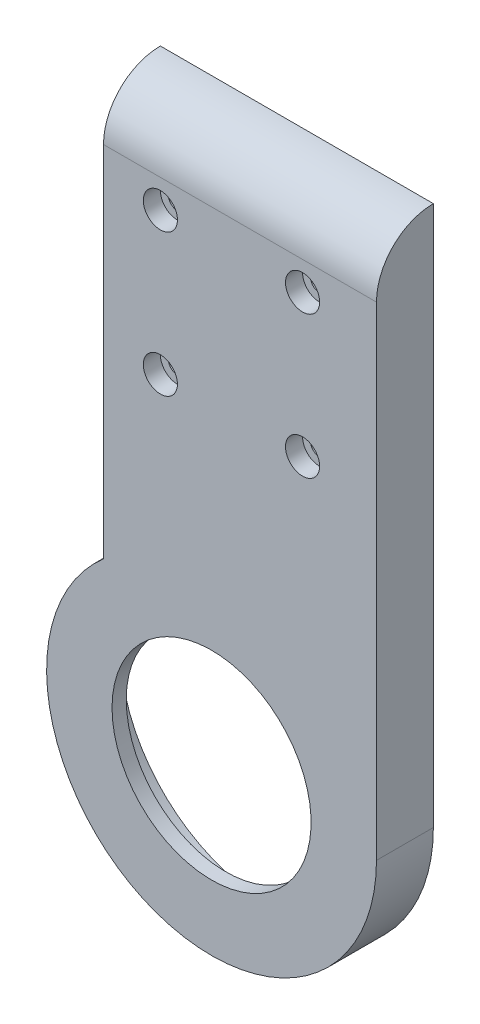
ISO-10303-21;
HEADER;
FILE_DESCRIPTION(('STEP AP214'),'2;1');
FILE_NAME('part.step','',(''),(''),'','','');
FILE_SCHEMA(('AUTOMOTIVE_DESIGN { 1 0 10303 214 1 1 1 1 }'));
ENDSEC;
DATA;
#1=APPLICATION_CONTEXT('core data for automotive mechanical design processes');
#2=APPLICATION_PROTOCOL_DEFINITION('international standard','automotive_design',2000,#1);
#3=PRODUCT_CONTEXT('',#1,'mechanical');
#4=PRODUCT('Part','Part','',(#3));
#5=PRODUCT_RELATED_PRODUCT_CATEGORY('part','',(#4));
#6=PRODUCT_DEFINITION_FORMATION('','',#4);
#7=PRODUCT_DEFINITION_CONTEXT('part definition',#1,'design');
#8=PRODUCT_DEFINITION('design','',#6,#7);
#9=PRODUCT_DEFINITION_SHAPE('','',#8);
#10=(LENGTH_UNIT() NAMED_UNIT(*) SI_UNIT(.MILLI.,.METRE.));
#11=(NAMED_UNIT(*) PLANE_ANGLE_UNIT() SI_UNIT($,.RADIAN.));
#12=(NAMED_UNIT(*) SI_UNIT($,.STERADIAN.) SOLID_ANGLE_UNIT());
#13=UNCERTAINTY_MEASURE_WITH_UNIT(LENGTH_MEASURE(1.E-05),#10,'distance_accuracy_value','');
#14=(GEOMETRIC_REPRESENTATION_CONTEXT(3) GLOBAL_UNCERTAINTY_ASSIGNED_CONTEXT((#13)) GLOBAL_UNIT_ASSIGNED_CONTEXT((#10,
#11,#12)) REPRESENTATION_CONTEXT('',''));
#15=CARTESIAN_POINT('',(0.,0.,0.));
#16=DIRECTION('',(0.,0.,1.));
#17=DIRECTION('',(1.,0.,0.));
#18=AXIS2_PLACEMENT_3D('',#15,#16,#17);
#19=CARTESIAN_POINT('',(-9.,80.,0.));
#20=DIRECTION('',(0.,0.,1.));
#21=DIRECTION('',(1.,0.,0.));
#22=AXIS2_PLACEMENT_3D('',#19,#20,#21);
#23=CYLINDRICAL_SURFACE('',#22,1.60000000000001);
#24=CARTESIAN_POINT('',(-9.,80.,0.));
#25=DIRECTION('',(0.,0.,1.));
#26=DIRECTION('',(1.,0.,0.));
#27=AXIS2_PLACEMENT_3D('',#24,#25,#26);
#28=CIRCLE('',#27,1.60000000000001);
#29=CARTESIAN_POINT('',(-7.39999999999999,80.,0.));
#30=VERTEX_POINT('',#29);
#31=EDGE_CURVE('E141',#30,#30,#28,.T.);
#32=ORIENTED_EDGE('',*,*,#31,.F.);
#33=EDGE_LOOP('',(#32));
#34=FACE_BOUND('',#33,.T.);
#35=CARTESIAN_POINT('',(-9.,80.,7.));
#36=DIRECTION('',(0.,0.,1.));
#37=DIRECTION('',(1.,0.,0.));
#38=AXIS2_PLACEMENT_3D('',#35,#36,#37);
#39=CIRCLE('',#38,1.60000000000001);
#40=CARTESIAN_POINT('',(-7.39999999999999,80.,7.));
#41=VERTEX_POINT('',#40);
#42=EDGE_CURVE('E44',#41,#41,#39,.F.);
#43=ORIENTED_EDGE('',*,*,#42,.F.);
#44=EDGE_LOOP('',(#43));
#45=FACE_BOUND('',#44,.T.);
#46=ADVANCED_FACE('F40',(#34,#45),#23,.F.);
#47=CARTESIAN_POINT('',(16.,80.,0.));
#48=DIRECTION('',(0.,0.,1.));
#49=DIRECTION('',(1.,0.,0.));
#50=AXIS2_PLACEMENT_3D('',#47,#48,#49);
#51=CYLINDRICAL_SURFACE('',#50,1.60000000000001);
#52=CARTESIAN_POINT('',(16.,80.,0.));
#53=DIRECTION('',(0.,0.,1.));
#54=DIRECTION('',(1.,0.,0.));
#55=AXIS2_PLACEMENT_3D('',#52,#53,#54);
#56=CIRCLE('',#55,1.60000000000001);
#57=CARTESIAN_POINT('',(17.6,80.,0.));
#58=VERTEX_POINT('',#57);
#59=EDGE_CURVE('E137',#58,#58,#56,.T.);
#60=ORIENTED_EDGE('',*,*,#59,.F.);
#61=EDGE_LOOP('',(#60));
#62=FACE_BOUND('',#61,.T.);
#63=CARTESIAN_POINT('',(16.,80.,7.));
#64=DIRECTION('',(0.,0.,1.));
#65=DIRECTION('',(1.,0.,0.));
#66=AXIS2_PLACEMENT_3D('',#63,#64,#65);
#67=CIRCLE('',#66,1.60000000000001);
#68=CARTESIAN_POINT('',(17.6,80.,7.));
#69=VERTEX_POINT('',#68);
#70=EDGE_CURVE('E123',#69,#69,#67,.F.);
#71=ORIENTED_EDGE('',*,*,#70,.F.);
#72=EDGE_LOOP('',(#71));
#73=FACE_BOUND('',#72,.T.);
#74=ADVANCED_FACE('F183',(#62,#73),#51,.F.);
#75=CARTESIAN_POINT('',(16.0000000000013,55.,0.));
#76=DIRECTION('',(0.,0.,1.));
#77=DIRECTION('',(1.,0.,0.));
#78=AXIS2_PLACEMENT_3D('',#75,#76,#77);
#79=CYLINDRICAL_SURFACE('',#78,1.6);
#80=CARTESIAN_POINT('',(16.0000000000013,55.,0.));
#81=DIRECTION('',(0.,0.,1.));
#82=DIRECTION('',(1.,0.,0.));
#83=AXIS2_PLACEMENT_3D('',#80,#81,#82);
#84=CIRCLE('',#83,1.6);
#85=CARTESIAN_POINT('',(17.6000000000013,55.,0.));
#86=VERTEX_POINT('',#85);
#87=EDGE_CURVE('E132',#86,#86,#84,.T.);
#88=ORIENTED_EDGE('',*,*,#87,.F.);
#89=EDGE_LOOP('',(#88));
#90=FACE_BOUND('',#89,.T.);
#91=CARTESIAN_POINT('',(16.0000000000013,55.,7.));
#92=DIRECTION('',(0.,0.,1.));
#93=DIRECTION('',(1.,0.,0.));
#94=AXIS2_PLACEMENT_3D('',#91,#92,#93);
#95=CIRCLE('',#94,1.6);
#96=CARTESIAN_POINT('',(17.6000000000013,55.,7.));
#97=VERTEX_POINT('',#96);
#98=EDGE_CURVE('E120',#97,#97,#95,.F.);
#99=ORIENTED_EDGE('',*,*,#98,.F.);
#100=EDGE_LOOP('',(#99));
#101=FACE_BOUND('',#100,.T.);
#102=ADVANCED_FACE('F189',(#90,#101),#79,.F.);
#103=CARTESIAN_POINT('',(-8.99999999999867,55.,0.));
#104=DIRECTION('',(0.,0.,1.));
#105=DIRECTION('',(1.,0.,0.));
#106=AXIS2_PLACEMENT_3D('',#103,#104,#105);
#107=CYLINDRICAL_SURFACE('',#106,1.59999999999999);
#108=CARTESIAN_POINT('',(-8.99999999999867,55.,0.));
#109=DIRECTION('',(0.,0.,1.));
#110=DIRECTION('',(1.,0.,0.));
#111=AXIS2_PLACEMENT_3D('',#108,#109,#110);
#112=CIRCLE('',#111,1.59999999999999);
#113=CARTESIAN_POINT('',(-7.39999999999868,55.,0.));
#114=VERTEX_POINT('',#113);
#115=EDGE_CURVE('E128',#114,#114,#112,.T.);
#116=ORIENTED_EDGE('',*,*,#115,.F.);
#117=EDGE_LOOP('',(#116));
#118=FACE_BOUND('',#117,.T.);
#119=CARTESIAN_POINT('',(-8.99999999999867,55.,7.));
#120=DIRECTION('',(0.,0.,1.));
#121=DIRECTION('',(1.,0.,0.));
#122=AXIS2_PLACEMENT_3D('',#119,#120,#121);
#123=CIRCLE('',#122,1.59999999999999);
#124=CARTESIAN_POINT('',(-7.39999999999868,55.,7.));
#125=VERTEX_POINT('',#124);
#126=EDGE_CURVE('E117',#125,#125,#123,.F.);
#127=ORIENTED_EDGE('',*,*,#126,.F.);
#128=EDGE_LOOP('',(#127));
#129=FACE_BOUND('',#128,.T.);
#130=ADVANCED_FACE('F195',(#118,#129),#107,.F.);
#131=CARTESIAN_POINT('',(0.,0.,7.5));
#132=DIRECTION('',(0.,0.,-1.));
#133=DIRECTION('',(-1.,0.,0.));
#134=AXIS2_PLACEMENT_3D('',#131,#132,#133);
#135=PLANE('',#134);
#136=CARTESIAN_POINT('',(0.,0.,7.5));
#137=DIRECTION('',(0.,0.,-1.));
#138=DIRECTION('',(-1.,0.,0.));
#139=AXIS2_PLACEMENT_3D('',#136,#137,#138);
#140=CIRCLE('',#139,17.5);
#141=CARTESIAN_POINT('',(-17.5,0.,7.5));
#142=VERTEX_POINT('',#141);
#143=EDGE_CURVE('E151',#142,#142,#140,.T.);
#144=ORIENTED_EDGE('',*,*,#143,.F.);
#145=EDGE_LOOP('',(#144));
#146=FACE_BOUND('',#145,.T.);
#147=CARTESIAN_POINT('',(0.,0.,7.5));
#148=DIRECTION('',(0.,0.,-1.));
#149=DIRECTION('',(-1.,0.,0.));
#150=AXIS2_PLACEMENT_3D('',#147,#148,#149);
#151=CIRCLE('',#150,24.);
#152=CARTESIAN_POINT('',(-24.,0.,7.5));
#153=VERTEX_POINT('',#152);
#154=EDGE_CURVE('E107',#153,#153,#151,.F.);
#155=ORIENTED_EDGE('',*,*,#154,.F.);
#156=EDGE_LOOP('',(#155));
#157=FACE_BOUND('',#156,.T.);
#158=ADVANCED_FACE('F214',(#146,#157),#135,.T.);
#159=CARTESIAN_POINT('',(0.,0.,10.));
#160=DIRECTION('',(0.,0.,1.));
#161=DIRECTION('',(1.,0.,0.));
#162=AXIS2_PLACEMENT_3D('',#159,#160,#161);
#163=PLANE('',#162);
#164=CARTESIAN_POINT('',(-8.99999999999867,55.,10.));
#165=DIRECTION('',(0.,0.,1.));
#166=DIRECTION('',(1.,0.,0.));
#167=AXIS2_PLACEMENT_3D('',#164,#165,#166);
#168=CIRCLE('',#167,3.);
#169=CARTESIAN_POINT('',(-5.99999999999867,55.,10.));
#170=VERTEX_POINT('',#169);
#171=EDGE_CURVE('E249',#170,#170,#168,.T.);
#172=ORIENTED_EDGE('',*,*,#171,.F.);
#173=EDGE_LOOP('',(#172));
#174=FACE_BOUND('',#173,.T.);
#175=CARTESIAN_POINT('',(16.0000000000013,55.,10.));
#176=DIRECTION('',(0.,0.,1.));
#177=DIRECTION('',(1.,0.,0.));
#178=AXIS2_PLACEMENT_3D('',#175,#176,#177);
#179=CIRCLE('',#178,3.);
#180=CARTESIAN_POINT('',(19.0000000000013,55.,10.));
#181=VERTEX_POINT('',#180);
#182=EDGE_CURVE('E255',#181,#181,#179,.T.);
#183=ORIENTED_EDGE('',*,*,#182,.F.);
#184=EDGE_LOOP('',(#183));
#185=FACE_BOUND('',#184,.T.);
#186=CARTESIAN_POINT('',(16.,80.,10.));
#187=DIRECTION('',(0.,0.,1.));
#188=DIRECTION('',(1.,0.,0.));
#189=AXIS2_PLACEMENT_3D('',#186,#187,#188);
#190=CIRCLE('',#189,3.);
#191=CARTESIAN_POINT('',(19.,80.,10.));
#192=VERTEX_POINT('',#191);
#193=EDGE_CURVE('E243',#192,#192,#190,.T.);
#194=ORIENTED_EDGE('',*,*,#193,.F.);
#195=EDGE_LOOP('',(#194));
#196=FACE_BOUND('',#195,.T.);
#197=CARTESIAN_POINT('',(-9.,80.,10.));
#198=DIRECTION('',(0.,0.,1.));
#199=DIRECTION('',(1.,0.,0.));
#200=AXIS2_PLACEMENT_3D('',#197,#198,#199);
#201=CIRCLE('',#200,3.);
#202=CARTESIAN_POINT('',(-6.,80.,10.));
#203=VERTEX_POINT('',#202);
#204=EDGE_CURVE('E240',#203,#203,#201,.T.);
#205=ORIENTED_EDGE('',*,*,#204,.F.);
#206=EDGE_LOOP('',(#205));
#207=FACE_BOUND('',#206,.T.);
#208=CARTESIAN_POINT('',(0.,0.,10.));
#209=DIRECTION('',(0.,0.,-1.));
#210=DIRECTION('',(-1.,0.,0.));
#211=AXIS2_PLACEMENT_3D('',#208,#209,#210);
#212=CIRCLE('',#211,17.5);
#213=CARTESIAN_POINT('',(-17.5,0.,10.));
#214=VERTEX_POINT('',#213);
#215=EDGE_CURVE('E154',#214,#214,#212,.T.);
#216=ORIENTED_EDGE('',*,*,#215,.T.);
#217=EDGE_LOOP('',(#216));
#218=FACE_BOUND('',#217,.T.);
#219=DIRECTION('',(0.,-1.,0.));
#220=VECTOR('',#219,1.);
#221=CARTESIAN_POINT('',(29.,0.,10.));
#222=LINE('',#221,#220);
#223=CARTESIAN_POINT('',(29.,85.,10.));
#224=VERTEX_POINT('',#223);
#225=CARTESIAN_POINT('',(29.,0.,10.));
#226=VERTEX_POINT('',#225);
#227=EDGE_CURVE('E104',#224,#226,#222,.T.);
#228=ORIENTED_EDGE('',*,*,#227,.F.);
#229=DIRECTION('',(1.,0.,0.));
#230=VECTOR('',#229,1.);
#231=CARTESIAN_POINT('',(-19.,85.,10.));
#232=LINE('',#231,#230);
#233=CARTESIAN_POINT('',(-19.,85.,10.));
#234=VERTEX_POINT('',#233);
#235=EDGE_CURVE('E49',#224,#234,#232,.F.);
#236=ORIENTED_EDGE('',*,*,#235,.T.);
#237=DIRECTION('',(0.,1.,0.));
#238=VECTOR('',#237,1.);
#239=CARTESIAN_POINT('',(-19.,0.,10.));
#240=LINE('',#239,#238);
#241=CARTESIAN_POINT('',(-19.,21.9089023002066,10.));
#242=VERTEX_POINT('',#241);
#243=EDGE_CURVE('E101',#242,#234,#240,.T.);
#244=ORIENTED_EDGE('',*,*,#243,.F.);
#245=CARTESIAN_POINT('',(0.,0.,10.));
#246=DIRECTION('',(0.,0.,-1.));
#247=DIRECTION('',(-1.,0.,0.));
#248=AXIS2_PLACEMENT_3D('',#245,#246,#247);
#249=CIRCLE('',#248,29.);
#250=EDGE_CURVE('E93',#226,#242,#249,.T.);
#251=ORIENTED_EDGE('',*,*,#250,.F.);
#252=EDGE_LOOP('',(#228,#236,#244,#251));
#253=FACE_BOUND('',#252,.T.);
#254=ADVANCED_FACE('F224',(#174,#185,#196,#207,#218,#253),#163,.T.);
#255=CARTESIAN_POINT('',(0.,0.,0.));
#256=DIRECTION('',(0.,0.,1.));
#257=DIRECTION('',(1.,0.,0.));
#258=AXIS2_PLACEMENT_3D('',#255,#256,#257);
#259=PLANE('',#258);
#260=ORIENTED_EDGE('',*,*,#115,.T.);
#261=EDGE_LOOP('',(#260));
#262=FACE_BOUND('',#261,.T.);
#263=ORIENTED_EDGE('',*,*,#87,.T.);
#264=EDGE_LOOP('',(#263));
#265=FACE_BOUND('',#264,.T.);
#266=ORIENTED_EDGE('',*,*,#59,.T.);
#267=EDGE_LOOP('',(#266));
#268=FACE_BOUND('',#267,.T.);
#269=ORIENTED_EDGE('',*,*,#31,.T.);
#270=EDGE_LOOP('',(#269));
#271=FACE_BOUND('',#270,.T.);
#272=CARTESIAN_POINT('',(0.,0.,0.));
#273=DIRECTION('',(0.,0.,-1.));
#274=DIRECTION('',(-1.,0.,0.));
#275=AXIS2_PLACEMENT_3D('',#272,#273,#274);
#276=CIRCLE('',#275,26.1);
#277=CARTESIAN_POINT('',(-26.1,0.,0.));
#278=VERTEX_POINT('',#277);
#279=EDGE_CURVE('E157',#278,#278,#276,.T.);
#280=ORIENTED_EDGE('',*,*,#279,.F.);
#281=EDGE_LOOP('',(#280));
#282=FACE_BOUND('',#281,.T.);
#283=DIRECTION('',(0.,-1.,0.));
#284=VECTOR('',#283,1.);
#285=CARTESIAN_POINT('',(29.,0.,0.));
#286=LINE('',#285,#284);
#287=CARTESIAN_POINT('',(29.,95.,0.));
#288=VERTEX_POINT('',#287);
#289=CARTESIAN_POINT('',(29.,0.,0.));
#290=VERTEX_POINT('',#289);
#291=EDGE_CURVE('E97',#288,#290,#286,.T.);
#292=ORIENTED_EDGE('',*,*,#291,.T.);
#293=CARTESIAN_POINT('',(0.,0.,0.));
#294=DIRECTION('',(0.,0.,-1.));
#295=DIRECTION('',(-1.,0.,0.));
#296=AXIS2_PLACEMENT_3D('',#293,#294,#295);
#297=CIRCLE('',#296,29.);
#298=CARTESIAN_POINT('',(-19.,21.9089023002066,0.));
#299=VERTEX_POINT('',#298);
#300=EDGE_CURVE('E82',#290,#299,#297,.T.);
#301=ORIENTED_EDGE('',*,*,#300,.T.);
#302=DIRECTION('',(0.,1.,0.));
#303=VECTOR('',#302,1.);
#304=CARTESIAN_POINT('',(-19.,0.,0.));
#305=LINE('',#304,#303);
#306=CARTESIAN_POINT('',(-19.,95.,0.));
#307=VERTEX_POINT('',#306);
#308=EDGE_CURVE('E105',#299,#307,#305,.T.);
#309=ORIENTED_EDGE('',*,*,#308,.T.);
#310=DIRECTION('',(1.,0.,0.));
#311=VECTOR('',#310,1.);
#312=CARTESIAN_POINT('',(0.,95.,0.));
#313=LINE('',#312,#311);
#314=EDGE_CURVE('E100',#307,#288,#313,.T.);
#315=ORIENTED_EDGE('',*,*,#314,.T.);
#316=EDGE_LOOP('',(#292,#301,#309,#315));
#317=FACE_BOUND('',#316,.T.);
#318=ADVANCED_FACE('F98',(#262,#265,#268,#271,#282,#317),#259,.F.);
#319=CARTESIAN_POINT('',(29.,0.,0.));
#320=DIRECTION('',(-1.,0.,0.));
#321=DIRECTION('',(0.,-1.,0.));
#322=AXIS2_PLACEMENT_3D('',#319,#320,#321);
#323=PLANE('',#322);
#324=ORIENTED_EDGE('',*,*,#291,.F.);
#325=CARTESIAN_POINT('',(29.,85.,0.));
#326=DIRECTION('',(-1.,0.,0.));
#327=DIRECTION('',(0.,-1.,0.));
#328=AXIS2_PLACEMENT_3D('',#325,#326,#327);
#329=CIRCLE('',#328,10.);
#330=EDGE_CURVE('E64',#288,#224,#329,.F.);
#331=ORIENTED_EDGE('',*,*,#330,.T.);
#332=ORIENTED_EDGE('',*,*,#227,.T.);
#333=DIRECTION('',(0.,0.,1.));
#334=VECTOR('',#333,1.);
#335=CARTESIAN_POINT('',(29.,0.,0.));
#336=LINE('',#335,#334);
#337=EDGE_CURVE('E86',#290,#226,#336,.T.);
#338=ORIENTED_EDGE('',*,*,#337,.F.);
#339=EDGE_LOOP('',(#324,#331,#332,#338));
#340=FACE_BOUND('',#339,.T.);
#341=ADVANCED_FACE('F103',(#340),#323,.F.);
#342=CARTESIAN_POINT('',(-19.,0.,0.));
#343=DIRECTION('',(1.,0.,0.));
#344=DIRECTION('',(0.,0.,-1.));
#345=AXIS2_PLACEMENT_3D('',#342,#343,#344);
#346=PLANE('',#345);
#347=ORIENTED_EDGE('',*,*,#243,.T.);
#348=CARTESIAN_POINT('',(-19.,85.,0.));
#349=DIRECTION('',(1.,0.,0.));
#350=DIRECTION('',(0.,0.,-1.));
#351=AXIS2_PLACEMENT_3D('',#348,#349,#350);
#352=CIRCLE('',#351,10.);
#353=EDGE_CURVE('E11',#234,#307,#352,.F.);
#354=ORIENTED_EDGE('',*,*,#353,.T.);
#355=ORIENTED_EDGE('',*,*,#308,.F.);
#356=DIRECTION('',(0.,0.,-1.));
#357=VECTOR('',#356,1.);
#358=CARTESIAN_POINT('',(-19.,21.9089023002066,10.));
#359=LINE('',#358,#357);
#360=EDGE_CURVE('E89',#299,#242,#359,.F.);
#361=ORIENTED_EDGE('',*,*,#360,.T.);
#362=EDGE_LOOP('',(#347,#354,#355,#361));
#363=FACE_BOUND('',#362,.T.);
#364=ADVANCED_FACE('F167',(#363),#346,.F.);
#365=CARTESIAN_POINT('',(0.,0.,10.));
#366=DIRECTION('',(0.,0.,-1.));
#367=DIRECTION('',(-1.,0.,0.));
#368=AXIS2_PLACEMENT_3D('',#365,#366,#367);
#369=CYLINDRICAL_SURFACE('',#368,29.);
#370=ORIENTED_EDGE('',*,*,#337,.T.);
#371=ORIENTED_EDGE('',*,*,#250,.T.);
#372=ORIENTED_EDGE('',*,*,#360,.F.);
#373=ORIENTED_EDGE('',*,*,#300,.F.);
#374=EDGE_LOOP('',(#370,#371,#372,#373));
#375=FACE_BOUND('',#374,.T.);
#376=ADVANCED_FACE('F84',(#375),#369,.T.);
#377=CARTESIAN_POINT('',(0.,0.,7.5));
#378=DIRECTION('',(0.,0.,-1.));
#379=DIRECTION('',(-1.,0.,0.));
#380=AXIS2_PLACEMENT_3D('',#377,#378,#379);
#381=CYLINDRICAL_SURFACE('',#380,26.1);
#382=CARTESIAN_POINT('',(0.,0.,7.5));
#383=DIRECTION('',(0.,0.,-1.));
#384=DIRECTION('',(-1.,0.,0.));
#385=AXIS2_PLACEMENT_3D('',#382,#383,#384);
#386=CIRCLE('',#385,26.1);
#387=CARTESIAN_POINT('',(-26.1,0.,7.5));
#388=VERTEX_POINT('',#387);
#389=EDGE_CURVE('E94',#388,#388,#386,.T.);
#390=ORIENTED_EDGE('',*,*,#389,.F.);
#391=EDGE_LOOP('',(#390));
#392=FACE_BOUND('',#391,.T.);
#393=ORIENTED_EDGE('',*,*,#279,.T.);
#394=EDGE_LOOP('',(#393));
#395=FACE_BOUND('',#394,.T.);
#396=ADVANCED_FACE('F212',(#392,#395),#381,.F.);
#397=CARTESIAN_POINT('',(0.,0.,7.5));
#398=DIRECTION('',(0.,0.,-1.));
#399=DIRECTION('',(-1.,0.,0.));
#400=AXIS2_PLACEMENT_3D('',#397,#398,#399);
#401=CIRCLE('',#400,26.05);
#402=CARTESIAN_POINT('',(-26.05,0.,7.5));
#403=VERTEX_POINT('',#402);
#404=EDGE_CURVE('E147',#403,#403,#401,.T.);
#405=ORIENTED_EDGE('',*,*,#404,.F.);
#406=EDGE_LOOP('',(#405));
#407=FACE_BOUND('',#406,.T.);
#408=ORIENTED_EDGE('',*,*,#389,.T.);
#409=EDGE_LOOP('',(#408));
#410=FACE_BOUND('',#409,.T.);
#411=ADVANCED_FACE('F208',(#407,#410),#135,.T.);
#412=CARTESIAN_POINT('',(0.,0.,10.));
#413=DIRECTION('',(0.,0.,-1.));
#414=DIRECTION('',(-1.,0.,0.));
#415=AXIS2_PLACEMENT_3D('',#412,#413,#414);
#416=CYLINDRICAL_SURFACE('',#415,17.5);
#417=ORIENTED_EDGE('',*,*,#215,.F.);
#418=EDGE_LOOP('',(#417));
#419=FACE_BOUND('',#418,.T.);
#420=ORIENTED_EDGE('',*,*,#143,.T.);
#421=EDGE_LOOP('',(#420));
#422=FACE_BOUND('',#421,.T.);
#423=ADVANCED_FACE('F201',(#419,#422),#416,.F.);
#424=CARTESIAN_POINT('',(0.,0.,6.));
#425=DIRECTION('',(0.,0.,-1.));
#426=DIRECTION('',(-1.,0.,0.));
#427=AXIS2_PLACEMENT_3D('',#424,#425,#426);
#428=PLANE('',#427);
#429=CARTESIAN_POINT('',(0.,0.,6.));
#430=DIRECTION('',(0.,0.,-1.));
#431=DIRECTION('',(-1.,0.,0.));
#432=AXIS2_PLACEMENT_3D('',#429,#430,#431);
#433=CIRCLE('',#432,26.05);
#434=CARTESIAN_POINT('',(-26.05,0.,6.));
#435=VERTEX_POINT('',#434);
#436=EDGE_CURVE('E148',#435,#435,#433,.T.);
#437=ORIENTED_EDGE('',*,*,#436,.T.);
#438=EDGE_LOOP('',(#437));
#439=FACE_BOUND('',#438,.T.);
#440=CARTESIAN_POINT('',(0.,0.,6.));
#441=DIRECTION('',(0.,0.,-1.));
#442=DIRECTION('',(-1.,0.,0.));
#443=AXIS2_PLACEMENT_3D('',#440,#441,#442);
#444=CIRCLE('',#443,24.);
#445=CARTESIAN_POINT('',(-24.,0.,6.));
#446=VERTEX_POINT('',#445);
#447=EDGE_CURVE('E144',#446,#446,#444,.T.);
#448=ORIENTED_EDGE('',*,*,#447,.F.);
#449=EDGE_LOOP('',(#448));
#450=FACE_BOUND('',#449,.T.);
#451=ADVANCED_FACE('F198',(#439,#450),#428,.T.);
#452=CARTESIAN_POINT('',(0.,0.,6.));
#453=DIRECTION('',(0.,0.,1.));
#454=DIRECTION('',(1.,0.,0.));
#455=AXIS2_PLACEMENT_3D('',#452,#453,#454);
#456=CYLINDRICAL_SURFACE('',#455,26.05);
#457=ORIENTED_EDGE('',*,*,#436,.F.);
#458=EDGE_LOOP('',(#457));
#459=FACE_BOUND('',#458,.T.);
#460=ORIENTED_EDGE('',*,*,#404,.T.);
#461=EDGE_LOOP('',(#460));
#462=FACE_BOUND('',#461,.T.);
#463=ADVANCED_FACE('F179',(#459,#462),#456,.T.);
#464=CARTESIAN_POINT('',(0.,0.,6.));
#465=DIRECTION('',(0.,0.,1.));
#466=DIRECTION('',(1.,0.,0.));
#467=AXIS2_PLACEMENT_3D('',#464,#465,#466);
#468=CYLINDRICAL_SURFACE('',#467,24.);
#469=ORIENTED_EDGE('',*,*,#447,.T.);
#470=EDGE_LOOP('',(#469));
#471=FACE_BOUND('',#470,.T.);
#472=ORIENTED_EDGE('',*,*,#154,.T.);
#473=EDGE_LOOP('',(#472));
#474=FACE_BOUND('',#473,.T.);
#475=ADVANCED_FACE('F171',(#471,#474),#468,.F.);
#476=CARTESIAN_POINT('',(0.,85.,0.));
#477=DIRECTION('',(-1.,0.,0.));
#478=DIRECTION('',(0.,0.,1.));
#479=AXIS2_PLACEMENT_3D('',#476,#477,#478);
#480=CYLINDRICAL_SURFACE('',#479,10.);
#481=ORIENTED_EDGE('',*,*,#353,.F.);
#482=ORIENTED_EDGE('',*,*,#235,.F.);
#483=ORIENTED_EDGE('',*,*,#330,.F.);
#484=ORIENTED_EDGE('',*,*,#314,.F.);
#485=EDGE_LOOP('',(#481,#482,#483,#484));
#486=FACE_BOUND('',#485,.T.);
#487=ADVANCED_FACE('F42',(#486),#480,.T.);
#488=CARTESIAN_POINT('',(-8.99999999999867,55.,7.));
#489=DIRECTION('',(0.,0.,1.));
#490=DIRECTION('',(1.,0.,0.));
#491=AXIS2_PLACEMENT_3D('',#488,#489,#490);
#492=PLANE('',#491);
#493=CARTESIAN_POINT('',(-8.99999999999867,55.,7.));
#494=DIRECTION('',(0.,0.,1.));
#495=DIRECTION('',(1.,0.,0.));
#496=AXIS2_PLACEMENT_3D('',#493,#494,#495);
#497=CIRCLE('',#496,3.);
#498=CARTESIAN_POINT('',(-5.99999999999867,55.,7.));
#499=VERTEX_POINT('',#498);
#500=EDGE_CURVE('E246',#499,#499,#497,.T.);
#501=ORIENTED_EDGE('',*,*,#500,.T.);
#502=EDGE_LOOP('',(#501));
#503=FACE_BOUND('',#502,.T.);
#504=ORIENTED_EDGE('',*,*,#126,.T.);
#505=EDGE_LOOP('',(#504));
#506=FACE_BOUND('',#505,.T.);
#507=ADVANCED_FACE('F170',(#503,#506),#492,.T.);
#508=CARTESIAN_POINT('',(-8.99999999999867,55.,7.));
#509=DIRECTION('',(0.,0.,1.));
#510=DIRECTION('',(1.,0.,0.));
#511=AXIS2_PLACEMENT_3D('',#508,#509,#510);
#512=CYLINDRICAL_SURFACE('',#511,3.);
#513=ORIENTED_EDGE('',*,*,#500,.F.);
#514=EDGE_LOOP('',(#513));
#515=FACE_BOUND('',#514,.T.);
#516=ORIENTED_EDGE('',*,*,#171,.T.);
#517=EDGE_LOOP('',(#516));
#518=FACE_BOUND('',#517,.T.);
#519=ADVANCED_FACE('F176',(#515,#518),#512,.F.);
#520=CARTESIAN_POINT('',(16.0000000000013,55.,7.));
#521=DIRECTION('',(0.,0.,1.));
#522=DIRECTION('',(1.,0.,0.));
#523=AXIS2_PLACEMENT_3D('',#520,#521,#522);
#524=PLANE('',#523);
#525=CARTESIAN_POINT('',(16.0000000000013,55.,7.));
#526=DIRECTION('',(0.,0.,1.));
#527=DIRECTION('',(1.,0.,0.));
#528=AXIS2_PLACEMENT_3D('',#525,#526,#527);
#529=CIRCLE('',#528,3.);
#530=CARTESIAN_POINT('',(19.0000000000013,55.,7.));
#531=VERTEX_POINT('',#530);
#532=EDGE_CURVE('E252',#531,#531,#529,.T.);
#533=ORIENTED_EDGE('',*,*,#532,.T.);
#534=EDGE_LOOP('',(#533));
#535=FACE_BOUND('',#534,.T.);
#536=ORIENTED_EDGE('',*,*,#98,.T.);
#537=EDGE_LOOP('',(#536));
#538=FACE_BOUND('',#537,.T.);
#539=ADVANCED_FACE('F302',(#535,#538),#524,.T.);
#540=CARTESIAN_POINT('',(16.0000000000013,55.,7.));
#541=DIRECTION('',(0.,0.,1.));
#542=DIRECTION('',(1.,0.,0.));
#543=AXIS2_PLACEMENT_3D('',#540,#541,#542);
#544=CYLINDRICAL_SURFACE('',#543,3.);
#545=ORIENTED_EDGE('',*,*,#532,.F.);
#546=EDGE_LOOP('',(#545));
#547=FACE_BOUND('',#546,.T.);
#548=ORIENTED_EDGE('',*,*,#182,.T.);
#549=EDGE_LOOP('',(#548));
#550=FACE_BOUND('',#549,.T.);
#551=ADVANCED_FACE('F306',(#547,#550),#544,.F.);
#552=CARTESIAN_POINT('',(16.,80.,7.));
#553=DIRECTION('',(0.,0.,1.));
#554=DIRECTION('',(1.,0.,0.));
#555=AXIS2_PLACEMENT_3D('',#552,#553,#554);
#556=PLANE('',#555);
#557=CARTESIAN_POINT('',(16.,80.,7.));
#558=DIRECTION('',(0.,0.,1.));
#559=DIRECTION('',(1.,0.,0.));
#560=AXIS2_PLACEMENT_3D('',#557,#558,#559);
#561=CIRCLE('',#560,3.);
#562=CARTESIAN_POINT('',(19.,80.,7.));
#563=VERTEX_POINT('',#562);
#564=EDGE_CURVE('E258',#563,#563,#561,.T.);
#565=ORIENTED_EDGE('',*,*,#564,.T.);
#566=EDGE_LOOP('',(#565));
#567=FACE_BOUND('',#566,.T.);
#568=ORIENTED_EDGE('',*,*,#70,.T.);
#569=EDGE_LOOP('',(#568));
#570=FACE_BOUND('',#569,.T.);
#571=ADVANCED_FACE('F310',(#567,#570),#556,.T.);
#572=CARTESIAN_POINT('',(16.,80.,7.));
#573=DIRECTION('',(0.,0.,1.));
#574=DIRECTION('',(1.,0.,0.));
#575=AXIS2_PLACEMENT_3D('',#572,#573,#574);
#576=CYLINDRICAL_SURFACE('',#575,3.);
#577=ORIENTED_EDGE('',*,*,#564,.F.);
#578=EDGE_LOOP('',(#577));
#579=FACE_BOUND('',#578,.T.);
#580=ORIENTED_EDGE('',*,*,#193,.T.);
#581=EDGE_LOOP('',(#580));
#582=FACE_BOUND('',#581,.T.);
#583=ADVANCED_FACE('F264',(#579,#582),#576,.F.);
#584=CARTESIAN_POINT('',(-9.,80.,7.));
#585=DIRECTION('',(0.,0.,1.));
#586=DIRECTION('',(1.,0.,0.));
#587=AXIS2_PLACEMENT_3D('',#584,#585,#586);
#588=PLANE('',#587);
#589=CARTESIAN_POINT('',(-9.,80.,7.));
#590=DIRECTION('',(0.,0.,1.));
#591=DIRECTION('',(1.,0.,0.));
#592=AXIS2_PLACEMENT_3D('',#589,#590,#591);
#593=CIRCLE('',#592,3.);
#594=CARTESIAN_POINT('',(-6.,80.,7.));
#595=VERTEX_POINT('',#594);
#596=EDGE_CURVE('E121',#595,#595,#593,.T.);
#597=ORIENTED_EDGE('',*,*,#596,.T.);
#598=EDGE_LOOP('',(#597));
#599=FACE_BOUND('',#598,.T.);
#600=ORIENTED_EDGE('',*,*,#42,.T.);
#601=EDGE_LOOP('',(#600));
#602=FACE_BOUND('',#601,.T.);
#603=ADVANCED_FACE('F295',(#599,#602),#588,.T.);
#604=CARTESIAN_POINT('',(-9.,80.,7.));
#605=DIRECTION('',(0.,0.,1.));
#606=DIRECTION('',(1.,0.,0.));
#607=AXIS2_PLACEMENT_3D('',#604,#605,#606);
#608=CYLINDRICAL_SURFACE('',#607,3.);
#609=ORIENTED_EDGE('',*,*,#596,.F.);
#610=EDGE_LOOP('',(#609));
#611=FACE_BOUND('',#610,.T.);
#612=ORIENTED_EDGE('',*,*,#204,.T.);
#613=EDGE_LOOP('',(#612));
#614=FACE_BOUND('',#613,.T.);
#615=ADVANCED_FACE('F292',(#611,#614),#608,.F.);
#616=CLOSED_SHELL('',(#46,#74,#102,#130,#158,#254,#318,#341,#364,#376,#396,#411,#423,#451,#463,
#475,#487,#507,#519,#539,#551,#571,#583,#603,#615));
#617=MANIFOLD_SOLID_BREP('B2',#616);
#618=ADVANCED_BREP_SHAPE_REPRESENTATION('',(#18,#617),#14);
#619=SHAPE_DEFINITION_REPRESENTATION(#9,#618);
ENDSEC;
END-ISO-10303-21;
